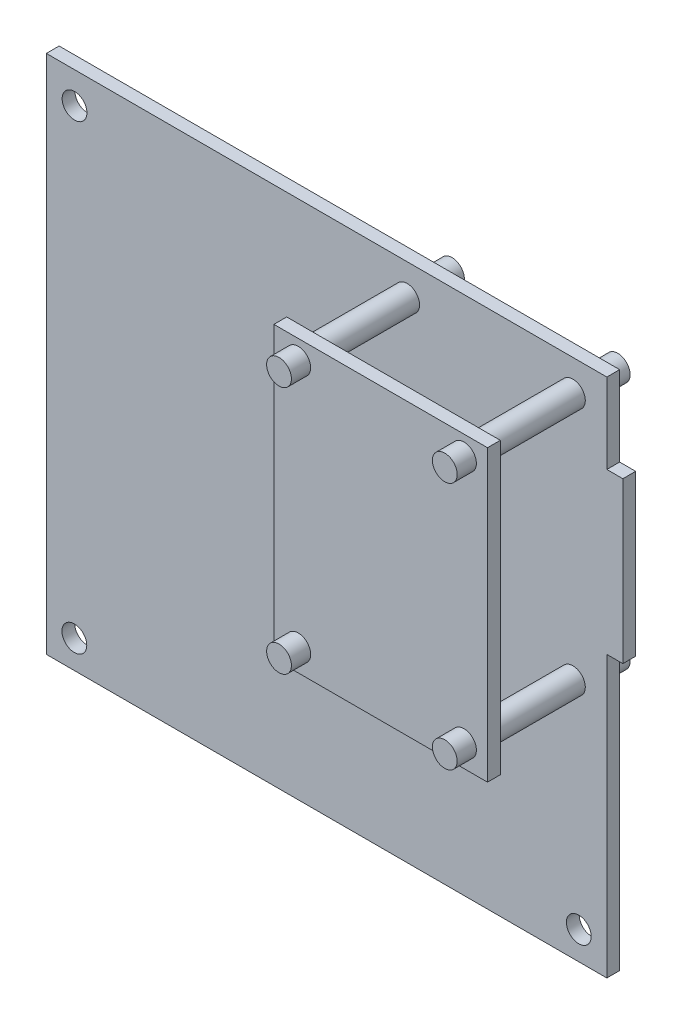
ISO-10303-21;
HEADER;
FILE_DESCRIPTION(('STEP AP214'),'2;1');
FILE_NAME('part.step','',(''),(''),'','','');
FILE_SCHEMA(('AUTOMOTIVE_DESIGN { 1 0 10303 214 1 1 1 1 }'));
ENDSEC;
DATA;
#1=APPLICATION_CONTEXT('core data for automotive mechanical design processes');
#2=APPLICATION_PROTOCOL_DEFINITION('international standard','automotive_design',2000,#1);
#3=PRODUCT_CONTEXT('',#1,'mechanical');
#4=PRODUCT('Part','Part','',(#3));
#5=PRODUCT_RELATED_PRODUCT_CATEGORY('part','',(#4));
#6=PRODUCT_DEFINITION_FORMATION('','',#4);
#7=PRODUCT_DEFINITION_CONTEXT('part definition',#1,'design');
#8=PRODUCT_DEFINITION('design','',#6,#7);
#9=PRODUCT_DEFINITION_SHAPE('','',#8);
#10=(LENGTH_UNIT() NAMED_UNIT(*) SI_UNIT(.MILLI.,.METRE.));
#11=(NAMED_UNIT(*) PLANE_ANGLE_UNIT() SI_UNIT($,.RADIAN.));
#12=(NAMED_UNIT(*) SI_UNIT($,.STERADIAN.) SOLID_ANGLE_UNIT());
#13=UNCERTAINTY_MEASURE_WITH_UNIT(LENGTH_MEASURE(1.E-05),#10,'distance_accuracy_value','');
#14=(GEOMETRIC_REPRESENTATION_CONTEXT(3) GLOBAL_UNCERTAINTY_ASSIGNED_CONTEXT((#13)) GLOBAL_UNIT_ASSIGNED_CONTEXT((#10,
#11,#12)) REPRESENTATION_CONTEXT('',''));
#15=CARTESIAN_POINT('',(0.,0.,0.));
#16=DIRECTION('',(0.,0.,1.));
#17=DIRECTION('',(1.,0.,0.));
#18=AXIS2_PLACEMENT_3D('',#15,#16,#17);
#19=CARTESIAN_POINT('',(45.06,61.1,17.6));
#20=DIRECTION('',(0.,0.,-1.));
#21=DIRECTION('',(-1.,0.,0.));
#22=AXIS2_PLACEMENT_3D('',#19,#20,#21);
#23=CYLINDRICAL_SURFACE('',#22,1.55);
#24=CARTESIAN_POINT('',(45.06,61.1,1.6));
#25=DIRECTION('',(0.,0.,1.));
#26=DIRECTION('',(1.,0.,0.));
#27=AXIS2_PLACEMENT_3D('',#24,#25,#26);
#28=CIRCLE('',#27,1.55);
#29=CARTESIAN_POINT('',(46.61,61.1,1.6));
#30=VERTEX_POINT('',#29);
#31=EDGE_CURVE('E239',#30,#30,#28,.T.);
#32=ORIENTED_EDGE('',*,*,#31,.T.);
#33=EDGE_LOOP('',(#32));
#34=FACE_BOUND('',#33,.T.);
#35=CARTESIAN_POINT('',(45.06,61.1,13.6));
#36=DIRECTION('',(0.,0.,1.));
#37=DIRECTION('',(1.,0.,0.));
#38=AXIS2_PLACEMENT_3D('',#35,#36,#37);
#39=CIRCLE('',#38,1.55);
#40=CARTESIAN_POINT('',(46.61,61.1,13.6));
#41=VERTEX_POINT('',#40);
#42=EDGE_CURVE('E11',#41,#41,#39,.T.);
#43=ORIENTED_EDGE('',*,*,#42,.F.);
#44=EDGE_LOOP('',(#43));
#45=FACE_BOUND('',#44,.T.);
#46=ADVANCED_FACE('F36',(#34,#45),#23,.T.);
#47=CARTESIAN_POINT('',(65.76,61.1,17.6));
#48=DIRECTION('',(0.,0.,-1.));
#49=DIRECTION('',(-1.,0.,0.));
#50=AXIS2_PLACEMENT_3D('',#47,#48,#49);
#51=CYLINDRICAL_SURFACE('',#50,1.54999999999999);
#52=CARTESIAN_POINT('',(65.76,61.1,1.6));
#53=DIRECTION('',(0.,0.,1.));
#54=DIRECTION('',(1.,0.,0.));
#55=AXIS2_PLACEMENT_3D('',#52,#53,#54);
#56=CIRCLE('',#55,1.54999999999999);
#57=CARTESIAN_POINT('',(67.31,61.1,1.6));
#58=VERTEX_POINT('',#57);
#59=EDGE_CURVE('E236',#58,#58,#56,.T.);
#60=ORIENTED_EDGE('',*,*,#59,.T.);
#61=EDGE_LOOP('',(#60));
#62=FACE_BOUND('',#61,.T.);
#63=CARTESIAN_POINT('',(65.76,61.1,13.6));
#64=DIRECTION('',(0.,0.,1.));
#65=DIRECTION('',(1.,0.,0.));
#66=AXIS2_PLACEMENT_3D('',#63,#64,#65);
#67=CIRCLE('',#66,1.54999999999999);
#68=CARTESIAN_POINT('',(67.31,61.1,13.6));
#69=VERTEX_POINT('',#68);
#70=EDGE_CURVE('E46',#69,#69,#67,.T.);
#71=ORIENTED_EDGE('',*,*,#70,.F.);
#72=EDGE_LOOP('',(#71));
#73=FACE_BOUND('',#72,.T.);
#74=ADVANCED_FACE('F296',(#62,#73),#51,.T.);
#75=CARTESIAN_POINT('',(45.06,30.1,17.6));
#76=DIRECTION('',(0.,0.,-1.));
#77=DIRECTION('',(-1.,0.,0.));
#78=AXIS2_PLACEMENT_3D('',#75,#76,#77);
#79=CYLINDRICAL_SURFACE('',#78,1.55);
#80=CARTESIAN_POINT('',(45.06,30.1,1.6));
#81=DIRECTION('',(0.,0.,1.));
#82=DIRECTION('',(1.,0.,0.));
#83=AXIS2_PLACEMENT_3D('',#80,#81,#82);
#84=CIRCLE('',#83,1.55);
#85=CARTESIAN_POINT('',(46.61,30.1,1.6));
#86=VERTEX_POINT('',#85);
#87=EDGE_CURVE('E233',#86,#86,#84,.T.);
#88=ORIENTED_EDGE('',*,*,#87,.T.);
#89=EDGE_LOOP('',(#88));
#90=FACE_BOUND('',#89,.T.);
#91=CARTESIAN_POINT('',(45.06,30.1,13.6));
#92=DIRECTION('',(0.,0.,1.));
#93=DIRECTION('',(1.,0.,0.));
#94=AXIS2_PLACEMENT_3D('',#91,#92,#93);
#95=CIRCLE('',#94,1.55);
#96=CARTESIAN_POINT('',(46.61,30.1,13.6));
#97=VERTEX_POINT('',#96);
#98=EDGE_CURVE('E184',#97,#97,#95,.T.);
#99=ORIENTED_EDGE('',*,*,#98,.F.);
#100=EDGE_LOOP('',(#99));
#101=FACE_BOUND('',#100,.T.);
#102=ADVANCED_FACE('F303',(#90,#101),#79,.T.);
#103=CARTESIAN_POINT('',(65.76,30.1,17.6));
#104=DIRECTION('',(0.,0.,-1.));
#105=DIRECTION('',(-1.,0.,0.));
#106=AXIS2_PLACEMENT_3D('',#103,#104,#105);
#107=CYLINDRICAL_SURFACE('',#106,1.54999999999999);
#108=CARTESIAN_POINT('',(65.76,30.1,1.6));
#109=DIRECTION('',(0.,0.,1.));
#110=DIRECTION('',(1.,0.,0.));
#111=AXIS2_PLACEMENT_3D('',#108,#109,#110);
#112=CIRCLE('',#111,1.54999999999999);
#113=CARTESIAN_POINT('',(67.31,30.1,1.6));
#114=VERTEX_POINT('',#113);
#115=EDGE_CURVE('E230',#114,#114,#112,.T.);
#116=ORIENTED_EDGE('',*,*,#115,.T.);
#117=EDGE_LOOP('',(#116));
#118=FACE_BOUND('',#117,.T.);
#119=CARTESIAN_POINT('',(65.76,30.1,13.6));
#120=DIRECTION('',(0.,0.,1.));
#121=DIRECTION('',(1.,0.,0.));
#122=AXIS2_PLACEMENT_3D('',#119,#120,#121);
#123=CIRCLE('',#122,1.54999999999999);
#124=CARTESIAN_POINT('',(67.31,30.1,13.6));
#125=VERTEX_POINT('',#124);
#126=EDGE_CURVE('E182',#125,#125,#123,.T.);
#127=ORIENTED_EDGE('',*,*,#126,.F.);
#128=EDGE_LOOP('',(#127));
#129=FACE_BOUND('',#128,.T.);
#130=ADVANCED_FACE('F427',(#118,#129),#107,.T.);
#131=CARTESIAN_POINT('',(0.,0.,1.6));
#132=DIRECTION('',(0.,0.,-1.));
#133=DIRECTION('',(-1.,0.,0.));
#134=AXIS2_PLACEMENT_3D('',#131,#132,#133);
#135=PLANE('',#134);
#136=DIRECTION('',(0.,-1.,0.));
#137=VECTOR('',#136,1.);
#138=CARTESIAN_POINT('',(0.,0.,1.6));
#139=LINE('',#138,#137);
#140=CARTESIAN_POINT('',(0.,65.,1.6));
#141=VERTEX_POINT('',#140);
#142=CARTESIAN_POINT('',(0.,0.,1.6));
#143=VERTEX_POINT('',#142);
#144=EDGE_CURVE('E156',#141,#143,#139,.T.);
#145=ORIENTED_EDGE('',*,*,#144,.T.);
#146=DIRECTION('',(1.,0.,0.));
#147=VECTOR('',#146,1.);
#148=CARTESIAN_POINT('',(0.,0.,1.6));
#149=LINE('',#148,#147);
#150=CARTESIAN_POINT('',(70.,0.,1.6));
#151=VERTEX_POINT('',#150);
#152=EDGE_CURVE('E100',#143,#151,#149,.T.);
#153=ORIENTED_EDGE('',*,*,#152,.T.);
#154=DIRECTION('',(0.,1.,0.));
#155=VECTOR('',#154,1.);
#156=CARTESIAN_POINT('',(70.,0.,1.6));
#157=LINE('',#156,#155);
#158=CARTESIAN_POINT('',(70.,35.,1.6));
#159=VERTEX_POINT('',#158);
#160=EDGE_CURVE('E261',#151,#159,#157,.T.);
#161=ORIENTED_EDGE('',*,*,#160,.T.);
#162=DIRECTION('',(1.,0.,0.));
#163=VECTOR('',#162,1.);
#164=CARTESIAN_POINT('',(70.,35.,1.6));
#165=LINE('',#164,#163);
#166=CARTESIAN_POINT('',(72.,35.,1.6));
#167=VERTEX_POINT('',#166);
#168=EDGE_CURVE('E263',#159,#167,#165,.T.);
#169=ORIENTED_EDGE('',*,*,#168,.T.);
#170=DIRECTION('',(0.,1.,0.));
#171=VECTOR('',#170,1.);
#172=CARTESIAN_POINT('',(72.,55.,1.6));
#173=LINE('',#172,#171);
#174=CARTESIAN_POINT('',(72.,55.,1.6));
#175=VERTEX_POINT('',#174);
#176=EDGE_CURVE('E123',#167,#175,#173,.T.);
#177=ORIENTED_EDGE('',*,*,#176,.T.);
#178=DIRECTION('',(-1.,0.,0.));
#179=VECTOR('',#178,1.);
#180=CARTESIAN_POINT('',(70.,55.,1.6));
#181=LINE('',#180,#179);
#182=CARTESIAN_POINT('',(70.,55.,1.6));
#183=VERTEX_POINT('',#182);
#184=EDGE_CURVE('E116',#175,#183,#181,.T.);
#185=ORIENTED_EDGE('',*,*,#184,.T.);
#186=DIRECTION('',(0.,1.,0.));
#187=VECTOR('',#186,1.);
#188=CARTESIAN_POINT('',(70.,55.,1.6));
#189=LINE('',#188,#187);
#190=CARTESIAN_POINT('',(70.,65.,1.6));
#191=VERTEX_POINT('',#190);
#192=EDGE_CURVE('E121',#183,#191,#189,.T.);
#193=ORIENTED_EDGE('',*,*,#192,.T.);
#194=DIRECTION('',(-1.,0.,0.));
#195=VECTOR('',#194,1.);
#196=CARTESIAN_POINT('',(0.,65.,1.6));
#197=LINE('',#196,#195);
#198=EDGE_CURVE('E55',#191,#141,#197,.T.);
#199=ORIENTED_EDGE('',*,*,#198,.T.);
#200=EDGE_LOOP('',(#145,#153,#161,#169,#177,#185,#193,#199));
#201=FACE_BOUND('',#200,.T.);
#202=CARTESIAN_POINT('',(3.523,61.1,1.6));
#203=DIRECTION('',(0.,0.,1.));
#204=DIRECTION('',(1.,0.,0.));
#205=AXIS2_PLACEMENT_3D('',#202,#203,#204);
#206=CIRCLE('',#205,1.55000000000001);
#207=CARTESIAN_POINT('',(5.07300000000001,61.1,1.6));
#208=VERTEX_POINT('',#207);
#209=EDGE_CURVE('E145',#208,#208,#206,.T.);
#210=ORIENTED_EDGE('',*,*,#209,.F.);
#211=EDGE_LOOP('',(#210));
#212=FACE_BOUND('',#211,.T.);
#213=CARTESIAN_POINT('',(3.5,3.5,1.6));
#214=DIRECTION('',(0.,0.,1.));
#215=DIRECTION('',(1.,0.,0.));
#216=AXIS2_PLACEMENT_3D('',#213,#214,#215);
#217=CIRCLE('',#216,1.55);
#218=CARTESIAN_POINT('',(5.05,3.5,1.6));
#219=VERTEX_POINT('',#218);
#220=EDGE_CURVE('E249',#219,#219,#217,.T.);
#221=ORIENTED_EDGE('',*,*,#220,.F.);
#222=EDGE_LOOP('',(#221));
#223=FACE_BOUND('',#222,.T.);
#224=CARTESIAN_POINT('',(66.5,3.5,1.6));
#225=DIRECTION('',(0.,0.,1.));
#226=DIRECTION('',(1.,0.,0.));
#227=AXIS2_PLACEMENT_3D('',#224,#225,#226);
#228=CIRCLE('',#227,1.54999999999999);
#229=CARTESIAN_POINT('',(68.05,3.5,1.6));
#230=VERTEX_POINT('',#229);
#231=EDGE_CURVE('E243',#230,#230,#228,.T.);
#232=ORIENTED_EDGE('',*,*,#231,.F.);
#233=EDGE_LOOP('',(#232));
#234=FACE_BOUND('',#233,.T.);
#235=ORIENTED_EDGE('',*,*,#31,.F.);
#236=EDGE_LOOP('',(#235));
#237=FACE_BOUND('',#236,.T.);
#238=ORIENTED_EDGE('',*,*,#59,.F.);
#239=EDGE_LOOP('',(#238));
#240=FACE_BOUND('',#239,.T.);
#241=ORIENTED_EDGE('',*,*,#87,.F.);
#242=EDGE_LOOP('',(#241));
#243=FACE_BOUND('',#242,.T.);
#244=ORIENTED_EDGE('',*,*,#115,.F.);
#245=EDGE_LOOP('',(#244));
#246=FACE_BOUND('',#245,.T.);
#247=ADVANCED_FACE('F118',(#201,#212,#223,#234,#237,#240,#243,#246),#135,.F.);
#248=CARTESIAN_POINT('',(0.,0.,0.));
#249=DIRECTION('',(0.,0.,-1.));
#250=DIRECTION('',(-1.,0.,0.));
#251=AXIS2_PLACEMENT_3D('',#248,#249,#250);
#252=PLANE('',#251);
#253=CARTESIAN_POINT('',(65.76,30.1,0.));
#254=DIRECTION('',(0.,0.,-1.));
#255=DIRECTION('',(-1.,0.,0.));
#256=AXIS2_PLACEMENT_3D('',#253,#254,#255);
#257=CIRCLE('',#256,1.54999999999999);
#258=CARTESIAN_POINT('',(64.21,30.1,0.));
#259=VERTEX_POINT('',#258);
#260=EDGE_CURVE('E180',#259,#259,#257,.T.);
#261=ORIENTED_EDGE('',*,*,#260,.F.);
#262=EDGE_LOOP('',(#261));
#263=FACE_BOUND('',#262,.T.);
#264=CARTESIAN_POINT('',(45.06,30.1,0.));
#265=DIRECTION('',(0.,0.,-1.));
#266=DIRECTION('',(-1.,0.,0.));
#267=AXIS2_PLACEMENT_3D('',#264,#265,#266);
#268=CIRCLE('',#267,1.55);
#269=CARTESIAN_POINT('',(43.51,30.1,0.));
#270=VERTEX_POINT('',#269);
#271=EDGE_CURVE('E177',#270,#270,#268,.T.);
#272=ORIENTED_EDGE('',*,*,#271,.F.);
#273=EDGE_LOOP('',(#272));
#274=FACE_BOUND('',#273,.T.);
#275=CARTESIAN_POINT('',(65.76,61.1,0.));
#276=DIRECTION('',(0.,0.,-1.));
#277=DIRECTION('',(-1.,0.,0.));
#278=AXIS2_PLACEMENT_3D('',#275,#276,#277);
#279=CIRCLE('',#278,1.54999999999999);
#280=CARTESIAN_POINT('',(64.21,61.1,0.));
#281=VERTEX_POINT('',#280);
#282=EDGE_CURVE('E174',#281,#281,#279,.T.);
#283=ORIENTED_EDGE('',*,*,#282,.F.);
#284=EDGE_LOOP('',(#283));
#285=FACE_BOUND('',#284,.T.);
#286=CARTESIAN_POINT('',(45.06,61.1,0.));
#287=DIRECTION('',(0.,0.,-1.));
#288=DIRECTION('',(-1.,0.,0.));
#289=AXIS2_PLACEMENT_3D('',#286,#287,#288);
#290=CIRCLE('',#289,1.55);
#291=CARTESIAN_POINT('',(43.51,61.1,0.));
#292=VERTEX_POINT('',#291);
#293=EDGE_CURVE('E171',#292,#292,#290,.T.);
#294=ORIENTED_EDGE('',*,*,#293,.F.);
#295=EDGE_LOOP('',(#294));
#296=FACE_BOUND('',#295,.T.);
#297=CARTESIAN_POINT('',(3.5,3.5,0.));
#298=DIRECTION('',(0.,0.,1.));
#299=DIRECTION('',(1.,0.,0.));
#300=AXIS2_PLACEMENT_3D('',#297,#298,#299);
#301=CIRCLE('',#300,1.55);
#302=CARTESIAN_POINT('',(5.05,3.5,0.));
#303=VERTEX_POINT('',#302);
#304=EDGE_CURVE('E246',#303,#303,#301,.T.);
#305=ORIENTED_EDGE('',*,*,#304,.T.);
#306=EDGE_LOOP('',(#305));
#307=FACE_BOUND('',#306,.T.);
#308=DIRECTION('',(0.,-1.,0.));
#309=VECTOR('',#308,1.);
#310=CARTESIAN_POINT('',(0.,0.,0.));
#311=LINE('',#310,#309);
#312=CARTESIAN_POINT('',(0.,65.,0.));
#313=VERTEX_POINT('',#312);
#314=CARTESIAN_POINT('',(0.,0.,0.));
#315=VERTEX_POINT('',#314);
#316=EDGE_CURVE('E141',#313,#315,#311,.T.);
#317=ORIENTED_EDGE('',*,*,#316,.F.);
#318=DIRECTION('',(-1.,0.,0.));
#319=VECTOR('',#318,1.);
#320=CARTESIAN_POINT('',(0.,65.,0.));
#321=LINE('',#320,#319);
#322=CARTESIAN_POINT('',(70.,65.,0.));
#323=VERTEX_POINT('',#322);
#324=EDGE_CURVE('E91',#323,#313,#321,.T.);
#325=ORIENTED_EDGE('',*,*,#324,.F.);
#326=DIRECTION('',(0.,1.,0.));
#327=VECTOR('',#326,1.);
#328=CARTESIAN_POINT('',(70.,55.,0.));
#329=LINE('',#328,#327);
#330=CARTESIAN_POINT('',(70.,55.,0.));
#331=VERTEX_POINT('',#330);
#332=EDGE_CURVE('E85',#331,#323,#329,.T.);
#333=ORIENTED_EDGE('',*,*,#332,.F.);
#334=DIRECTION('',(-1.,0.,0.));
#335=VECTOR('',#334,1.);
#336=CARTESIAN_POINT('',(70.,55.,0.));
#337=LINE('',#336,#335);
#338=CARTESIAN_POINT('',(72.,55.,0.));
#339=VERTEX_POINT('',#338);
#340=EDGE_CURVE('E131',#339,#331,#337,.T.);
#341=ORIENTED_EDGE('',*,*,#340,.F.);
#342=DIRECTION('',(0.,1.,0.));
#343=VECTOR('',#342,1.);
#344=CARTESIAN_POINT('',(72.,55.,0.));
#345=LINE('',#344,#343);
#346=CARTESIAN_POINT('',(72.,35.,0.));
#347=VERTEX_POINT('',#346);
#348=EDGE_CURVE('E151',#347,#339,#345,.T.);
#349=ORIENTED_EDGE('',*,*,#348,.F.);
#350=DIRECTION('',(1.,0.,0.));
#351=VECTOR('',#350,1.);
#352=CARTESIAN_POINT('',(70.,35.,0.));
#353=LINE('',#352,#351);
#354=CARTESIAN_POINT('',(70.,35.,0.));
#355=VERTEX_POINT('',#354);
#356=EDGE_CURVE('E149',#355,#347,#353,.T.);
#357=ORIENTED_EDGE('',*,*,#356,.F.);
#358=DIRECTION('',(0.,1.,0.));
#359=VECTOR('',#358,1.);
#360=CARTESIAN_POINT('',(70.,0.,0.));
#361=LINE('',#360,#359);
#362=CARTESIAN_POINT('',(70.,0.,0.));
#363=VERTEX_POINT('',#362);
#364=EDGE_CURVE('E147',#363,#355,#361,.T.);
#365=ORIENTED_EDGE('',*,*,#364,.F.);
#366=DIRECTION('',(1.,0.,0.));
#367=VECTOR('',#366,1.);
#368=CARTESIAN_POINT('',(0.,0.,0.));
#369=LINE('',#368,#367);
#370=EDGE_CURVE('E144',#315,#363,#369,.T.);
#371=ORIENTED_EDGE('',*,*,#370,.F.);
#372=EDGE_LOOP('',(#317,#325,#333,#341,#349,#357,#365,#371));
#373=FACE_BOUND('',#372,.T.);
#374=CARTESIAN_POINT('',(3.523,61.1,0.));
#375=DIRECTION('',(0.,0.,1.));
#376=DIRECTION('',(1.,0.,0.));
#377=AXIS2_PLACEMENT_3D('',#374,#375,#376);
#378=CIRCLE('',#377,1.55000000000001);
#379=CARTESIAN_POINT('',(5.07300000000001,61.1,0.));
#380=VERTEX_POINT('',#379);
#381=EDGE_CURVE('E252',#380,#380,#378,.T.);
#382=ORIENTED_EDGE('',*,*,#381,.T.);
#383=EDGE_LOOP('',(#382));
#384=FACE_BOUND('',#383,.T.);
#385=CARTESIAN_POINT('',(66.5,3.5,0.));
#386=DIRECTION('',(0.,0.,1.));
#387=DIRECTION('',(1.,0.,0.));
#388=AXIS2_PLACEMENT_3D('',#385,#386,#387);
#389=CIRCLE('',#388,1.54999999999999);
#390=CARTESIAN_POINT('',(68.05,3.5,0.));
#391=VERTEX_POINT('',#390);
#392=EDGE_CURVE('E242',#391,#391,#389,.T.);
#393=ORIENTED_EDGE('',*,*,#392,.T.);
#394=EDGE_LOOP('',(#393));
#395=FACE_BOUND('',#394,.T.);
#396=ADVANCED_FACE('F276',(#263,#274,#285,#296,#307,#373,#384,#395),#252,.T.);
#397=CARTESIAN_POINT('',(0.,0.,1.6));
#398=DIRECTION('',(1.,0.,0.));
#399=DIRECTION('',(0.,0.,-1.));
#400=AXIS2_PLACEMENT_3D('',#397,#398,#399);
#401=PLANE('',#400);
#402=ORIENTED_EDGE('',*,*,#316,.T.);
#403=DIRECTION('',(0.,0.,-1.));
#404=VECTOR('',#403,1.);
#405=CARTESIAN_POINT('',(0.,0.,1.6));
#406=LINE('',#405,#404);
#407=EDGE_CURVE('E169',#143,#315,#406,.T.);
#408=ORIENTED_EDGE('',*,*,#407,.F.);
#409=ORIENTED_EDGE('',*,*,#144,.F.);
#410=DIRECTION('',(0.,0.,-1.));
#411=VECTOR('',#410,1.);
#412=CARTESIAN_POINT('',(0.,65.,1.6));
#413=LINE('',#412,#411);
#414=EDGE_CURVE('E137',#141,#313,#413,.T.);
#415=ORIENTED_EDGE('',*,*,#414,.T.);
#416=EDGE_LOOP('',(#402,#408,#409,#415));
#417=FACE_BOUND('',#416,.T.);
#418=ADVANCED_FACE('F38',(#417),#401,.F.);
#419=CARTESIAN_POINT('',(0.,0.,1.6));
#420=DIRECTION('',(0.,1.,0.));
#421=DIRECTION('',(0.,0.,1.));
#422=AXIS2_PLACEMENT_3D('',#419,#420,#421);
#423=PLANE('',#422);
#424=ORIENTED_EDGE('',*,*,#370,.T.);
#425=DIRECTION('',(0.,0.,-1.));
#426=VECTOR('',#425,1.);
#427=CARTESIAN_POINT('',(70.,0.,1.6));
#428=LINE('',#427,#426);
#429=EDGE_CURVE('E166',#151,#363,#428,.T.);
#430=ORIENTED_EDGE('',*,*,#429,.F.);
#431=ORIENTED_EDGE('',*,*,#152,.F.);
#432=ORIENTED_EDGE('',*,*,#407,.T.);
#433=EDGE_LOOP('',(#424,#430,#431,#432));
#434=FACE_BOUND('',#433,.T.);
#435=ADVANCED_FACE('F654',(#434),#423,.F.);
#436=CARTESIAN_POINT('',(70.,0.,1.6));
#437=DIRECTION('',(-1.,0.,0.));
#438=DIRECTION('',(0.,0.,1.));
#439=AXIS2_PLACEMENT_3D('',#436,#437,#438);
#440=PLANE('',#439);
#441=ORIENTED_EDGE('',*,*,#364,.T.);
#442=DIRECTION('',(0.,0.,-1.));
#443=VECTOR('',#442,1.);
#444=CARTESIAN_POINT('',(70.,35.,1.6));
#445=LINE('',#444,#443);
#446=EDGE_CURVE('E163',#159,#355,#445,.T.);
#447=ORIENTED_EDGE('',*,*,#446,.F.);
#448=ORIENTED_EDGE('',*,*,#160,.F.);
#449=ORIENTED_EDGE('',*,*,#429,.T.);
#450=EDGE_LOOP('',(#441,#447,#448,#449));
#451=FACE_BOUND('',#450,.T.);
#452=ADVANCED_FACE('F645',(#451),#440,.F.);
#453=CARTESIAN_POINT('',(70.,35.,1.6));
#454=DIRECTION('',(0.,1.,0.));
#455=DIRECTION('',(0.,0.,1.));
#456=AXIS2_PLACEMENT_3D('',#453,#454,#455);
#457=PLANE('',#456);
#458=ORIENTED_EDGE('',*,*,#356,.T.);
#459=DIRECTION('',(0.,0.,-1.));
#460=VECTOR('',#459,1.);
#461=CARTESIAN_POINT('',(72.,35.,1.6));
#462=LINE('',#461,#460);
#463=EDGE_CURVE('E160',#167,#347,#462,.T.);
#464=ORIENTED_EDGE('',*,*,#463,.F.);
#465=ORIENTED_EDGE('',*,*,#168,.F.);
#466=ORIENTED_EDGE('',*,*,#446,.T.);
#467=EDGE_LOOP('',(#458,#464,#465,#466));
#468=FACE_BOUND('',#467,.T.);
#469=ADVANCED_FACE('F269',(#468),#457,.F.);
#470=CARTESIAN_POINT('',(72.,55.,1.6));
#471=DIRECTION('',(-1.,0.,0.));
#472=DIRECTION('',(0.,0.,1.));
#473=AXIS2_PLACEMENT_3D('',#470,#471,#472);
#474=PLANE('',#473);
#475=ORIENTED_EDGE('',*,*,#348,.T.);
#476=DIRECTION('',(0.,0.,-1.));
#477=VECTOR('',#476,1.);
#478=CARTESIAN_POINT('',(72.,55.,1.6));
#479=LINE('',#478,#477);
#480=EDGE_CURVE('E132',#175,#339,#479,.T.);
#481=ORIENTED_EDGE('',*,*,#480,.F.);
#482=ORIENTED_EDGE('',*,*,#176,.F.);
#483=ORIENTED_EDGE('',*,*,#463,.T.);
#484=EDGE_LOOP('',(#475,#481,#482,#483));
#485=FACE_BOUND('',#484,.T.);
#486=ADVANCED_FACE('F273',(#485),#474,.F.);
#487=CARTESIAN_POINT('',(70.,55.,1.6));
#488=DIRECTION('',(0.,-1.,0.));
#489=DIRECTION('',(0.,0.,-1.));
#490=AXIS2_PLACEMENT_3D('',#487,#488,#489);
#491=PLANE('',#490);
#492=ORIENTED_EDGE('',*,*,#340,.T.);
#493=DIRECTION('',(0.,0.,-1.));
#494=VECTOR('',#493,1.);
#495=CARTESIAN_POINT('',(70.,55.,1.6));
#496=LINE('',#495,#494);
#497=EDGE_CURVE('E128',#183,#331,#496,.T.);
#498=ORIENTED_EDGE('',*,*,#497,.F.);
#499=ORIENTED_EDGE('',*,*,#184,.F.);
#500=ORIENTED_EDGE('',*,*,#480,.T.);
#501=EDGE_LOOP('',(#492,#498,#499,#500));
#502=FACE_BOUND('',#501,.T.);
#503=ADVANCED_FACE('F129',(#502),#491,.F.);
#504=CARTESIAN_POINT('',(70.,55.,1.6));
#505=DIRECTION('',(-1.,0.,0.));
#506=DIRECTION('',(0.,0.,1.));
#507=AXIS2_PLACEMENT_3D('',#504,#505,#506);
#508=PLANE('',#507);
#509=ORIENTED_EDGE('',*,*,#332,.T.);
#510=DIRECTION('',(0.,0.,-1.));
#511=VECTOR('',#510,1.);
#512=CARTESIAN_POINT('',(70.,65.,1.6));
#513=LINE('',#512,#511);
#514=EDGE_CURVE('E133',#191,#323,#513,.T.);
#515=ORIENTED_EDGE('',*,*,#514,.F.);
#516=ORIENTED_EDGE('',*,*,#192,.F.);
#517=ORIENTED_EDGE('',*,*,#497,.T.);
#518=EDGE_LOOP('',(#509,#515,#516,#517));
#519=FACE_BOUND('',#518,.T.);
#520=ADVANCED_FACE('F135',(#519),#508,.F.);
#521=CARTESIAN_POINT('',(0.,65.,1.6));
#522=DIRECTION('',(0.,-1.,0.));
#523=DIRECTION('',(0.,0.,-1.));
#524=AXIS2_PLACEMENT_3D('',#521,#522,#523);
#525=PLANE('',#524);
#526=ORIENTED_EDGE('',*,*,#324,.T.);
#527=ORIENTED_EDGE('',*,*,#414,.F.);
#528=ORIENTED_EDGE('',*,*,#198,.F.);
#529=ORIENTED_EDGE('',*,*,#514,.T.);
#530=EDGE_LOOP('',(#526,#527,#528,#529));
#531=FACE_BOUND('',#530,.T.);
#532=ADVANCED_FACE('F282',(#531),#525,.F.);
#533=CARTESIAN_POINT('',(3.523,61.1,1.6));
#534=DIRECTION('',(0.,0.,-1.));
#535=DIRECTION('',(-1.,0.,0.));
#536=AXIS2_PLACEMENT_3D('',#533,#534,#535);
#537=CYLINDRICAL_SURFACE('',#536,1.55000000000001);
#538=ORIENTED_EDGE('',*,*,#209,.T.);
#539=EDGE_LOOP('',(#538));
#540=FACE_BOUND('',#539,.T.);
#541=ORIENTED_EDGE('',*,*,#381,.F.);
#542=EDGE_LOOP('',(#541));
#543=FACE_BOUND('',#542,.T.);
#544=ADVANCED_FACE('F284',(#540,#543),#537,.F.);
#545=CARTESIAN_POINT('',(3.5,3.5,1.6));
#546=DIRECTION('',(0.,0.,-1.));
#547=DIRECTION('',(-1.,0.,0.));
#548=AXIS2_PLACEMENT_3D('',#545,#546,#547);
#549=CYLINDRICAL_SURFACE('',#548,1.55);
#550=ORIENTED_EDGE('',*,*,#220,.T.);
#551=EDGE_LOOP('',(#550));
#552=FACE_BOUND('',#551,.T.);
#553=ORIENTED_EDGE('',*,*,#304,.F.);
#554=EDGE_LOOP('',(#553));
#555=FACE_BOUND('',#554,.T.);
#556=ADVANCED_FACE('F290',(#552,#555),#549,.F.);
#557=CARTESIAN_POINT('',(66.5,3.5,1.6));
#558=DIRECTION('',(0.,0.,-1.));
#559=DIRECTION('',(-1.,0.,0.));
#560=AXIS2_PLACEMENT_3D('',#557,#558,#559);
#561=CYLINDRICAL_SURFACE('',#560,1.54999999999999);
#562=ORIENTED_EDGE('',*,*,#231,.T.);
#563=EDGE_LOOP('',(#562));
#564=FACE_BOUND('',#563,.T.);
#565=ORIENTED_EDGE('',*,*,#392,.F.);
#566=EDGE_LOOP('',(#565));
#567=FACE_BOUND('',#566,.T.);
#568=ADVANCED_FACE('F460',(#564,#567),#561,.F.);
#569=CARTESIAN_POINT('',(45.06,61.1,-4.));
#570=DIRECTION('',(0.,0.,1.));
#571=DIRECTION('',(1.,0.,0.));
#572=AXIS2_PLACEMENT_3D('',#569,#570,#571);
#573=CYLINDRICAL_SURFACE('',#572,1.55);
#574=CARTESIAN_POINT('',(45.06,61.1,-4.));
#575=DIRECTION('',(0.,0.,1.));
#576=DIRECTION('',(1.,0.,0.));
#577=AXIS2_PLACEMENT_3D('',#574,#575,#576);
#578=CIRCLE('',#577,1.55);
#579=CARTESIAN_POINT('',(46.61,61.1,-4.));
#580=VERTEX_POINT('',#579);
#581=EDGE_CURVE('E224',#580,#580,#578,.T.);
#582=ORIENTED_EDGE('',*,*,#581,.T.);
#583=EDGE_LOOP('',(#582));
#584=FACE_BOUND('',#583,.T.);
#585=ORIENTED_EDGE('',*,*,#293,.T.);
#586=EDGE_LOOP('',(#585));
#587=FACE_BOUND('',#586,.T.);
#588=ADVANCED_FACE('F457',(#584,#587),#573,.T.);
#589=CARTESIAN_POINT('',(45.06,61.1,-4.));
#590=DIRECTION('',(0.,0.,1.));
#591=DIRECTION('',(1.,0.,0.));
#592=AXIS2_PLACEMENT_3D('',#589,#590,#591);
#593=PLANE('',#592);
#594=ORIENTED_EDGE('',*,*,#581,.F.);
#595=EDGE_LOOP('',(#594));
#596=FACE_BOUND('',#595,.T.);
#597=ADVANCED_FACE('F447',(#596),#593,.F.);
#598=CARTESIAN_POINT('',(65.76,61.1,-4.));
#599=DIRECTION('',(0.,0.,1.));
#600=DIRECTION('',(1.,0.,0.));
#601=AXIS2_PLACEMENT_3D('',#598,#599,#600);
#602=CYLINDRICAL_SURFACE('',#601,1.54999999999999);
#603=CARTESIAN_POINT('',(65.76,61.1,-4.));
#604=DIRECTION('',(0.,0.,1.));
#605=DIRECTION('',(1.,0.,0.));
#606=AXIS2_PLACEMENT_3D('',#603,#604,#605);
#607=CIRCLE('',#606,1.54999999999999);
#608=CARTESIAN_POINT('',(67.31,61.1,-4.));
#609=VERTEX_POINT('',#608);
#610=EDGE_CURVE('E218',#609,#609,#607,.T.);
#611=ORIENTED_EDGE('',*,*,#610,.T.);
#612=EDGE_LOOP('',(#611));
#613=FACE_BOUND('',#612,.T.);
#614=ORIENTED_EDGE('',*,*,#282,.T.);
#615=EDGE_LOOP('',(#614));
#616=FACE_BOUND('',#615,.T.);
#617=ADVANCED_FACE('F444',(#613,#616),#602,.T.);
#618=CARTESIAN_POINT('',(65.76,61.1,-4.));
#619=DIRECTION('',(0.,0.,1.));
#620=DIRECTION('',(1.,0.,0.));
#621=AXIS2_PLACEMENT_3D('',#618,#619,#620);
#622=PLANE('',#621);
#623=ORIENTED_EDGE('',*,*,#610,.F.);
#624=EDGE_LOOP('',(#623));
#625=FACE_BOUND('',#624,.T.);
#626=ADVANCED_FACE('F431',(#625),#622,.F.);
#627=CARTESIAN_POINT('',(45.06,30.1,-4.));
#628=DIRECTION('',(0.,0.,1.));
#629=DIRECTION('',(1.,0.,0.));
#630=AXIS2_PLACEMENT_3D('',#627,#628,#629);
#631=CYLINDRICAL_SURFACE('',#630,1.55);
#632=CARTESIAN_POINT('',(45.06,30.1,-4.));
#633=DIRECTION('',(0.,0.,1.));
#634=DIRECTION('',(1.,0.,0.));
#635=AXIS2_PLACEMENT_3D('',#632,#633,#634);
#636=CIRCLE('',#635,1.55);
#637=CARTESIAN_POINT('',(46.61,30.1,-4.));
#638=VERTEX_POINT('',#637);
#639=EDGE_CURVE('E212',#638,#638,#636,.T.);
#640=ORIENTED_EDGE('',*,*,#639,.T.);
#641=EDGE_LOOP('',(#640));
#642=FACE_BOUND('',#641,.T.);
#643=ORIENTED_EDGE('',*,*,#271,.T.);
#644=EDGE_LOOP('',(#643));
#645=FACE_BOUND('',#644,.T.);
#646=ADVANCED_FACE('F428',(#642,#645),#631,.T.);
#647=CARTESIAN_POINT('',(45.06,30.1,-4.));
#648=DIRECTION('',(0.,0.,1.));
#649=DIRECTION('',(1.,0.,0.));
#650=AXIS2_PLACEMENT_3D('',#647,#648,#649);
#651=PLANE('',#650);
#652=ORIENTED_EDGE('',*,*,#639,.F.);
#653=EDGE_LOOP('',(#652));
#654=FACE_BOUND('',#653,.T.);
#655=ADVANCED_FACE('F416',(#654),#651,.F.);
#656=CARTESIAN_POINT('',(65.76,30.1,-4.));
#657=DIRECTION('',(0.,0.,1.));
#658=DIRECTION('',(1.,0.,0.));
#659=AXIS2_PLACEMENT_3D('',#656,#657,#658);
#660=CYLINDRICAL_SURFACE('',#659,1.54999999999999);
#661=CARTESIAN_POINT('',(65.76,30.1,-4.));
#662=DIRECTION('',(0.,0.,1.));
#663=DIRECTION('',(1.,0.,0.));
#664=AXIS2_PLACEMENT_3D('',#661,#662,#663);
#665=CIRCLE('',#664,1.54999999999999);
#666=CARTESIAN_POINT('',(67.31,30.1,-4.));
#667=VERTEX_POINT('',#666);
#668=EDGE_CURVE('E206',#667,#667,#665,.T.);
#669=ORIENTED_EDGE('',*,*,#668,.T.);
#670=EDGE_LOOP('',(#669));
#671=FACE_BOUND('',#670,.T.);
#672=ORIENTED_EDGE('',*,*,#260,.T.);
#673=EDGE_LOOP('',(#672));
#674=FACE_BOUND('',#673,.T.);
#675=ADVANCED_FACE('F412',(#671,#674),#660,.T.);
#676=CARTESIAN_POINT('',(0.,0.,-4.));
#677=DIRECTION('',(0.,0.,1.));
#678=DIRECTION('',(1.,0.,0.));
#679=AXIS2_PLACEMENT_3D('',#676,#677,#678);
#680=PLANE('',#679);
#681=ORIENTED_EDGE('',*,*,#668,.F.);
#682=EDGE_LOOP('',(#681));
#683=FACE_BOUND('',#682,.T.);
#684=ADVANCED_FACE('F406',(#683),#680,.F.);
#685=CARTESIAN_POINT('',(68.6953211481686,27.3277379566096,15.2));
#686=DIRECTION('',(-1.,0.,0.));
#687=DIRECTION('',(0.,0.,1.));
#688=AXIS2_PLACEMENT_3D('',#685,#686,#687);
#689=PLANE('',#688);
#690=DIRECTION('',(0.,1.,0.));
#691=VECTOR('',#690,1.);
#692=CARTESIAN_POINT('',(68.6953211481686,27.3277379566096,13.6));
#693=LINE('',#692,#691);
#694=CARTESIAN_POINT('',(68.6953211481686,27.3277379566096,13.6));
#695=VERTEX_POINT('',#694);
#696=CARTESIAN_POINT('',(68.6953211481686,63.5033251138894,13.6));
#697=VERTEX_POINT('',#696);
#698=EDGE_CURVE('E359',#695,#697,#693,.T.);
#699=ORIENTED_EDGE('',*,*,#698,.T.);
#700=DIRECTION('',(0.,0.,-1.));
#701=VECTOR('',#700,1.);
#702=CARTESIAN_POINT('',(68.6953211481686,63.5033251138894,15.2));
#703=LINE('',#702,#701);
#704=CARTESIAN_POINT('',(68.6953211481686,63.5033251138894,15.2));
#705=VERTEX_POINT('',#704);
#706=EDGE_CURVE('E194',#705,#697,#703,.T.);
#707=ORIENTED_EDGE('',*,*,#706,.F.);
#708=DIRECTION('',(0.,1.,0.));
#709=VECTOR('',#708,1.);
#710=CARTESIAN_POINT('',(68.6953211481686,27.3277379566096,15.2));
#711=LINE('',#710,#709);
#712=CARTESIAN_POINT('',(68.6953211481686,27.3277379566096,15.2));
#713=VERTEX_POINT('',#712);
#714=EDGE_CURVE('E339',#713,#705,#711,.T.);
#715=ORIENTED_EDGE('',*,*,#714,.F.);
#716=DIRECTION('',(0.,0.,-1.));
#717=VECTOR('',#716,1.);
#718=CARTESIAN_POINT('',(68.6953211481686,27.3277379566096,15.2));
#719=LINE('',#718,#717);
#720=EDGE_CURVE('E371',#713,#695,#719,.T.);
#721=ORIENTED_EDGE('',*,*,#720,.T.);
#722=EDGE_LOOP('',(#699,#707,#715,#721));
#723=FACE_BOUND('',#722,.T.);
#724=ADVANCED_FACE('F356',(#723),#689,.F.);
#725=CARTESIAN_POINT('',(68.6953211481686,63.5033251138894,15.2));
#726=DIRECTION('',(0.,-1.,0.));
#727=DIRECTION('',(0.,0.,-1.));
#728=AXIS2_PLACEMENT_3D('',#725,#726,#727);
#729=PLANE('',#728);
#730=DIRECTION('',(-1.,0.,0.));
#731=VECTOR('',#730,1.);
#732=CARTESIAN_POINT('',(68.6953211481686,63.5033251138894,13.6));
#733=LINE('',#732,#731);
#734=CARTESIAN_POINT('',(42.0173379769974,63.5033251138894,13.6));
#735=VERTEX_POINT('',#734);
#736=EDGE_CURVE('E379',#697,#735,#733,.T.);
#737=ORIENTED_EDGE('',*,*,#736,.T.);
#738=DIRECTION('',(0.,0.,-1.));
#739=VECTOR('',#738,1.);
#740=CARTESIAN_POINT('',(42.0173379769974,63.5033251138894,15.2));
#741=LINE('',#740,#739);
#742=CARTESIAN_POINT('',(42.0173379769974,63.5033251138894,15.2));
#743=VERTEX_POINT('',#742);
#744=EDGE_CURVE('E362',#743,#735,#741,.T.);
#745=ORIENTED_EDGE('',*,*,#744,.F.);
#746=DIRECTION('',(-1.,0.,0.));
#747=VECTOR('',#746,1.);
#748=CARTESIAN_POINT('',(68.6953211481686,63.5033251138894,15.2));
#749=LINE('',#748,#747);
#750=EDGE_CURVE('E344',#705,#743,#749,.T.);
#751=ORIENTED_EDGE('',*,*,#750,.F.);
#752=ORIENTED_EDGE('',*,*,#706,.T.);
#753=EDGE_LOOP('',(#737,#745,#751,#752));
#754=FACE_BOUND('',#753,.T.);
#755=ADVANCED_FACE('F396',(#754),#729,.F.);
#756=CARTESIAN_POINT('',(42.0173379769974,27.3277379566096,15.2));
#757=DIRECTION('',(1.,0.,0.));
#758=DIRECTION('',(0.,0.,-1.));
#759=AXIS2_PLACEMENT_3D('',#756,#757,#758);
#760=PLANE('',#759);
#761=DIRECTION('',(0.,-1.,0.));
#762=VECTOR('',#761,1.);
#763=CARTESIAN_POINT('',(42.0173379769974,27.3277379566096,13.6));
#764=LINE('',#763,#762);
#765=CARTESIAN_POINT('',(42.0173379769974,27.3277379566096,13.6));
#766=VERTEX_POINT('',#765);
#767=EDGE_CURVE('E377',#735,#766,#764,.T.);
#768=ORIENTED_EDGE('',*,*,#767,.T.);
#769=DIRECTION('',(0.,0.,-1.));
#770=VECTOR('',#769,1.);
#771=CARTESIAN_POINT('',(42.0173379769974,27.3277379566096,15.2));
#772=LINE('',#771,#770);
#773=CARTESIAN_POINT('',(42.0173379769974,27.3277379566096,15.2));
#774=VERTEX_POINT('',#773);
#775=EDGE_CURVE('E364',#774,#766,#772,.T.);
#776=ORIENTED_EDGE('',*,*,#775,.F.);
#777=DIRECTION('',(0.,-1.,0.));
#778=VECTOR('',#777,1.);
#779=CARTESIAN_POINT('',(42.0173379769974,27.3277379566096,15.2));
#780=LINE('',#779,#778);
#781=EDGE_CURVE('E383',#743,#774,#780,.T.);
#782=ORIENTED_EDGE('',*,*,#781,.F.);
#783=ORIENTED_EDGE('',*,*,#744,.T.);
#784=EDGE_LOOP('',(#768,#776,#782,#783));
#785=FACE_BOUND('',#784,.T.);
#786=ADVANCED_FACE('F388',(#785),#760,.F.);
#787=CARTESIAN_POINT('',(68.6953211481686,27.3277379566096,15.2));
#788=DIRECTION('',(0.,1.,0.));
#789=DIRECTION('',(-1.,0.,0.));
#790=AXIS2_PLACEMENT_3D('',#787,#788,#789);
#791=PLANE('',#790);
#792=DIRECTION('',(1.,0.,0.));
#793=VECTOR('',#792,1.);
#794=CARTESIAN_POINT('',(68.6953211481686,27.3277379566096,13.6));
#795=LINE('',#794,#793);
#796=EDGE_CURVE('E352',#766,#695,#795,.T.);
#797=ORIENTED_EDGE('',*,*,#796,.T.);
#798=ORIENTED_EDGE('',*,*,#720,.F.);
#799=DIRECTION('',(1.,0.,0.));
#800=VECTOR('',#799,1.);
#801=CARTESIAN_POINT('',(68.6953211481686,27.3277379566096,15.2));
#802=LINE('',#801,#800);
#803=EDGE_CURVE('E347',#774,#713,#802,.T.);
#804=ORIENTED_EDGE('',*,*,#803,.F.);
#805=ORIENTED_EDGE('',*,*,#775,.T.);
#806=EDGE_LOOP('',(#797,#798,#804,#805));
#807=FACE_BOUND('',#806,.T.);
#808=ADVANCED_FACE('F325',(#807),#791,.F.);
#809=CARTESIAN_POINT('',(0.,0.,15.2));
#810=DIRECTION('',(0.,0.,1.));
#811=DIRECTION('',(1.,0.,0.));
#812=AXIS2_PLACEMENT_3D('',#809,#810,#811);
#813=PLANE('',#812);
#814=CARTESIAN_POINT('',(45.06,61.1,15.2));
#815=DIRECTION('',(0.,0.,1.));
#816=DIRECTION('',(1.,0.,0.));
#817=AXIS2_PLACEMENT_3D('',#814,#815,#816);
#818=CIRCLE('',#817,1.55);
#819=CARTESIAN_POINT('',(46.61,61.1,15.2));
#820=VERTEX_POINT('',#819);
#821=EDGE_CURVE('E203',#820,#820,#818,.T.);
#822=ORIENTED_EDGE('',*,*,#821,.F.);
#823=EDGE_LOOP('',(#822));
#824=FACE_BOUND('',#823,.T.);
#825=CARTESIAN_POINT('',(65.76,61.1,15.2));
#826=DIRECTION('',(0.,0.,1.));
#827=DIRECTION('',(1.,0.,0.));
#828=AXIS2_PLACEMENT_3D('',#825,#826,#827);
#829=CIRCLE('',#828,1.54999999999999);
#830=CARTESIAN_POINT('',(67.31,61.1,15.2));
#831=VERTEX_POINT('',#830);
#832=EDGE_CURVE('E200',#831,#831,#829,.T.);
#833=ORIENTED_EDGE('',*,*,#832,.F.);
#834=EDGE_LOOP('',(#833));
#835=FACE_BOUND('',#834,.T.);
#836=CARTESIAN_POINT('',(45.06,30.1,15.2));
#837=DIRECTION('',(0.,0.,1.));
#838=DIRECTION('',(1.,0.,0.));
#839=AXIS2_PLACEMENT_3D('',#836,#837,#838);
#840=CIRCLE('',#839,1.55);
#841=CARTESIAN_POINT('',(46.61,30.1,15.2));
#842=VERTEX_POINT('',#841);
#843=EDGE_CURVE('E197',#842,#842,#840,.T.);
#844=ORIENTED_EDGE('',*,*,#843,.F.);
#845=EDGE_LOOP('',(#844));
#846=FACE_BOUND('',#845,.T.);
#847=CARTESIAN_POINT('',(65.76,30.1,15.2));
#848=DIRECTION('',(0.,0.,1.));
#849=DIRECTION('',(1.,0.,0.));
#850=AXIS2_PLACEMENT_3D('',#847,#848,#849);
#851=CIRCLE('',#850,1.54999999999999);
#852=CARTESIAN_POINT('',(67.31,30.1,15.2));
#853=VERTEX_POINT('',#852);
#854=EDGE_CURVE('E40',#853,#853,#851,.T.);
#855=ORIENTED_EDGE('',*,*,#854,.F.);
#856=EDGE_LOOP('',(#855));
#857=FACE_BOUND('',#856,.T.);
#858=ORIENTED_EDGE('',*,*,#714,.T.);
#859=ORIENTED_EDGE('',*,*,#750,.T.);
#860=ORIENTED_EDGE('',*,*,#781,.T.);
#861=ORIENTED_EDGE('',*,*,#803,.T.);
#862=EDGE_LOOP('',(#858,#859,#860,#861));
#863=FACE_BOUND('',#862,.T.);
#864=ADVANCED_FACE('F321',(#824,#835,#846,#857,#863),#813,.T.);
#865=CARTESIAN_POINT('',(0.,0.,13.6));
#866=DIRECTION('',(0.,0.,1.));
#867=DIRECTION('',(1.,0.,0.));
#868=AXIS2_PLACEMENT_3D('',#865,#866,#867);
#869=PLANE('',#868);
#870=ORIENTED_EDGE('',*,*,#42,.T.);
#871=EDGE_LOOP('',(#870));
#872=FACE_BOUND('',#871,.T.);
#873=ORIENTED_EDGE('',*,*,#70,.T.);
#874=EDGE_LOOP('',(#873));
#875=FACE_BOUND('',#874,.T.);
#876=ORIENTED_EDGE('',*,*,#98,.T.);
#877=EDGE_LOOP('',(#876));
#878=FACE_BOUND('',#877,.T.);
#879=ORIENTED_EDGE('',*,*,#126,.T.);
#880=EDGE_LOOP('',(#879));
#881=FACE_BOUND('',#880,.T.);
#882=ORIENTED_EDGE('',*,*,#698,.F.);
#883=ORIENTED_EDGE('',*,*,#796,.F.);
#884=ORIENTED_EDGE('',*,*,#767,.F.);
#885=ORIENTED_EDGE('',*,*,#736,.F.);
#886=EDGE_LOOP('',(#882,#883,#884,#885));
#887=FACE_BOUND('',#886,.T.);
#888=ADVANCED_FACE('F324',(#872,#875,#878,#881,#887),#869,.F.);
#889=CARTESIAN_POINT('',(0.,0.,17.6));
#890=DIRECTION('',(0.,0.,1.));
#891=DIRECTION('',(1.,0.,0.));
#892=AXIS2_PLACEMENT_3D('',#889,#890,#891);
#893=PLANE('',#892);
#894=CARTESIAN_POINT('',(65.76,30.1,17.6));
#895=DIRECTION('',(0.,0.,1.));
#896=DIRECTION('',(1.,0.,0.));
#897=AXIS2_PLACEMENT_3D('',#894,#895,#896);
#898=CIRCLE('',#897,1.54999999999999);
#899=CARTESIAN_POINT('',(67.31,30.1,17.6));
#900=VERTEX_POINT('',#899);
#901=EDGE_CURVE('E209',#900,#900,#898,.T.);
#902=ORIENTED_EDGE('',*,*,#901,.T.);
#903=EDGE_LOOP('',(#902));
#904=FACE_BOUND('',#903,.T.);
#905=ADVANCED_FACE('F418',(#904),#893,.T.);
#906=ORIENTED_EDGE('',*,*,#854,.T.);
#907=EDGE_LOOP('',(#906));
#908=FACE_BOUND('',#907,.T.);
#909=ORIENTED_EDGE('',*,*,#901,.F.);
#910=EDGE_LOOP('',(#909));
#911=FACE_BOUND('',#910,.T.);
#912=ADVANCED_FACE('F421',(#908,#911),#107,.T.);
#913=CARTESIAN_POINT('',(0.,0.,17.6));
#914=DIRECTION('',(0.,0.,1.));
#915=DIRECTION('',(1.,0.,0.));
#916=AXIS2_PLACEMENT_3D('',#913,#914,#915);
#917=PLANE('',#916);
#918=CARTESIAN_POINT('',(45.06,30.1,17.6));
#919=DIRECTION('',(0.,0.,1.));
#920=DIRECTION('',(1.,0.,0.));
#921=AXIS2_PLACEMENT_3D('',#918,#919,#920);
#922=CIRCLE('',#921,1.55);
#923=CARTESIAN_POINT('',(46.61,30.1,17.6));
#924=VERTEX_POINT('',#923);
#925=EDGE_CURVE('E215',#924,#924,#922,.T.);
#926=ORIENTED_EDGE('',*,*,#925,.T.);
#927=EDGE_LOOP('',(#926));
#928=FACE_BOUND('',#927,.T.);
#929=ADVANCED_FACE('F425',(#928),#917,.T.);
#930=ORIENTED_EDGE('',*,*,#843,.T.);
#931=EDGE_LOOP('',(#930));
#932=FACE_BOUND('',#931,.T.);
#933=ORIENTED_EDGE('',*,*,#925,.F.);
#934=EDGE_LOOP('',(#933));
#935=FACE_BOUND('',#934,.T.);
#936=ADVANCED_FACE('F438',(#932,#935),#79,.T.);
#937=CARTESIAN_POINT('',(0.,0.,17.6));
#938=DIRECTION('',(0.,0.,1.));
#939=DIRECTION('',(1.,0.,0.));
#940=AXIS2_PLACEMENT_3D('',#937,#938,#939);
#941=PLANE('',#940);
#942=CARTESIAN_POINT('',(65.76,61.1,17.6));
#943=DIRECTION('',(0.,0.,1.));
#944=DIRECTION('',(1.,0.,0.));
#945=AXIS2_PLACEMENT_3D('',#942,#943,#944);
#946=CIRCLE('',#945,1.54999999999999);
#947=CARTESIAN_POINT('',(67.31,61.1,17.6));
#948=VERTEX_POINT('',#947);
#949=EDGE_CURVE('E221',#948,#948,#946,.T.);
#950=ORIENTED_EDGE('',*,*,#949,.T.);
#951=EDGE_LOOP('',(#950));
#952=FACE_BOUND('',#951,.T.);
#953=ADVANCED_FACE('F442',(#952),#941,.T.);
#954=ORIENTED_EDGE('',*,*,#832,.T.);
#955=EDGE_LOOP('',(#954));
#956=FACE_BOUND('',#955,.T.);
#957=ORIENTED_EDGE('',*,*,#949,.F.);
#958=EDGE_LOOP('',(#957));
#959=FACE_BOUND('',#958,.T.);
#960=ADVANCED_FACE('F306',(#956,#959),#51,.T.);
#961=CARTESIAN_POINT('',(0.,0.,17.6));
#962=DIRECTION('',(0.,0.,1.));
#963=DIRECTION('',(1.,0.,0.));
#964=AXIS2_PLACEMENT_3D('',#961,#962,#963);
#965=PLANE('',#964);
#966=CARTESIAN_POINT('',(45.06,61.1,17.6));
#967=DIRECTION('',(0.,0.,1.));
#968=DIRECTION('',(1.,0.,0.));
#969=AXIS2_PLACEMENT_3D('',#966,#967,#968);
#970=CIRCLE('',#969,1.55);
#971=CARTESIAN_POINT('',(46.61,61.1,17.6));
#972=VERTEX_POINT('',#971);
#973=EDGE_CURVE('E227',#972,#972,#970,.T.);
#974=ORIENTED_EDGE('',*,*,#973,.T.);
#975=EDGE_LOOP('',(#974));
#976=FACE_BOUND('',#975,.T.);
#977=ADVANCED_FACE('F311',(#976),#965,.T.);
#978=ORIENTED_EDGE('',*,*,#821,.T.);
#979=EDGE_LOOP('',(#978));
#980=FACE_BOUND('',#979,.T.);
#981=ORIENTED_EDGE('',*,*,#973,.F.);
#982=EDGE_LOOP('',(#981));
#983=FACE_BOUND('',#982,.T.);
#984=ADVANCED_FACE('F299',(#980,#983),#23,.T.);
#985=CLOSED_SHELL('',(#46,#74,#102,#130,#247,#396,#418,#435,#452,#469,#486,#503,#520,#532,#544,
#556,#568,#588,#597,#617,#626,#646,#655,#675,#684,#724,#755,#786,#808,#864,#888,#905,#912,#929,
#936,#953,#960,#977,#984));
#986=MANIFOLD_SOLID_BREP('B2',#985);
#987=ADVANCED_BREP_SHAPE_REPRESENTATION('',(#18,#986),#14);
#988=SHAPE_DEFINITION_REPRESENTATION(#9,#987);
ENDSEC;
END-ISO-10303-21;
